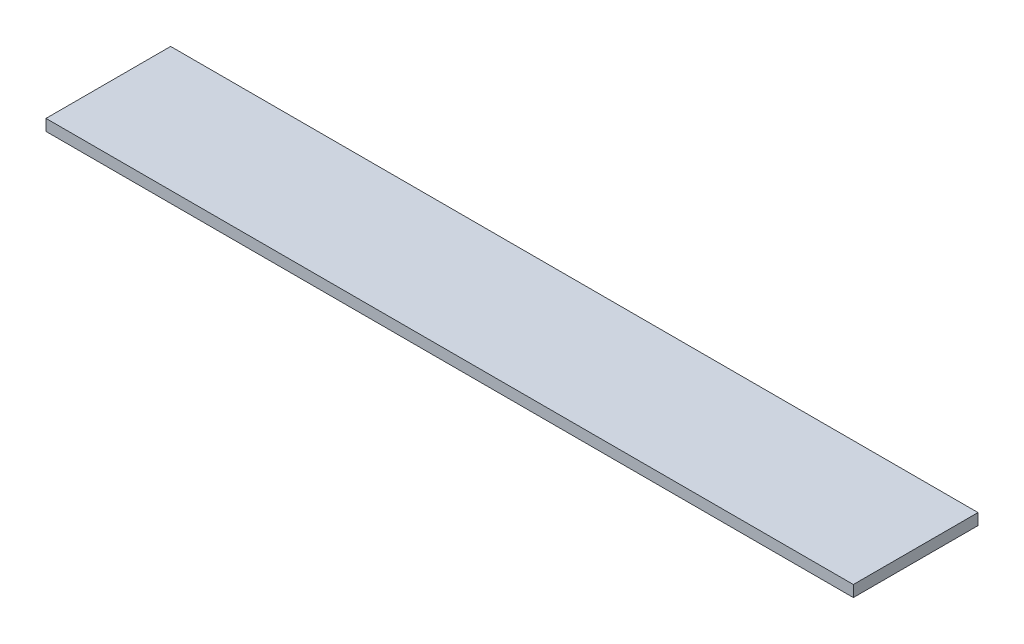
ISO-10303-21;
HEADER;
FILE_DESCRIPTION(('STEP AP214'),'2;1');
FILE_NAME('part.step','',(''),(''),'','','');
FILE_SCHEMA(('AUTOMOTIVE_DESIGN { 1 0 10303 214 1 1 1 1 }'));
ENDSEC;
DATA;
#1=APPLICATION_CONTEXT('core data for automotive mechanical design processes');
#2=APPLICATION_PROTOCOL_DEFINITION('international standard','automotive_design',2000,#1);
#3=PRODUCT_CONTEXT('',#1,'mechanical');
#4=PRODUCT('Part','Part','',(#3));
#5=PRODUCT_RELATED_PRODUCT_CATEGORY('part','',(#4));
#6=PRODUCT_DEFINITION_FORMATION('','',#4);
#7=PRODUCT_DEFINITION_CONTEXT('part definition',#1,'design');
#8=PRODUCT_DEFINITION('design','',#6,#7);
#9=PRODUCT_DEFINITION_SHAPE('','',#8);
#10=(LENGTH_UNIT() NAMED_UNIT(*) SI_UNIT(.MILLI.,.METRE.));
#11=(NAMED_UNIT(*) PLANE_ANGLE_UNIT() SI_UNIT($,.RADIAN.));
#12=(NAMED_UNIT(*) SI_UNIT($,.STERADIAN.) SOLID_ANGLE_UNIT());
#13=UNCERTAINTY_MEASURE_WITH_UNIT(LENGTH_MEASURE(1.E-05),#10,'distance_accuracy_value','');
#14=(GEOMETRIC_REPRESENTATION_CONTEXT(3) GLOBAL_UNCERTAINTY_ASSIGNED_CONTEXT((#13)) GLOBAL_UNIT_ASSIGNED_CONTEXT((#10,
#11,#12)) REPRESENTATION_CONTEXT('',''));
#15=CARTESIAN_POINT('',(0.,0.,0.));
#16=DIRECTION('',(0.,0.,1.));
#17=DIRECTION('',(1.,0.,0.));
#18=AXIS2_PLACEMENT_3D('',#15,#16,#17);
#19=CARTESIAN_POINT('',(-285.000000000039,-4.00000000000027,0.));
#20=DIRECTION('',(-0.999999999999999,0.,0.));
#21=DIRECTION('',(0.,0.,0.999999999999999));
#22=AXIS2_PLACEMENT_3D('',#19,#20,#21);
#23=PLANE('',#22);
#24=DIRECTION('',(0.,0.,0.999999999999999));
#25=VECTOR('',#24,1.);
#26=CARTESIAN_POINT('',(-285.000000000039,-2.91433543964104E-13,0.));
#27=LINE('',#26,#25);
#28=CARTESIAN_POINT('',(-285.000000000039,-2.91433543964104E-13,0.));
#29=VERTEX_POINT('',#28);
#30=CARTESIAN_POINT('',(-285.000000000039,-2.25514051876985E-13,43.9999999999999));
#31=VERTEX_POINT('',#30);
#32=EDGE_CURVE('E98',#29,#31,#27,.T.);
#33=ORIENTED_EDGE('',*,*,#32,.F.);
#34=DIRECTION('',(0.,0.999999999999999,0.));
#35=VECTOR('',#34,1.);
#36=CARTESIAN_POINT('',(-285.000000000039,-4.00000000000027,0.));
#37=LINE('',#36,#35);
#38=CARTESIAN_POINT('',(-285.000000000039,-4.00000000000027,0.));
#39=VERTEX_POINT('',#38);
#40=EDGE_CURVE('E11',#39,#29,#37,.T.);
#41=ORIENTED_EDGE('',*,*,#40,.F.);
#42=DIRECTION('',(0.,0.,0.999999999999999));
#43=VECTOR('',#42,1.);
#44=CARTESIAN_POINT('',(-285.000000000039,-4.00000000000027,0.));
#45=LINE('',#44,#43);
#46=CARTESIAN_POINT('',(-285.000000000039,-4.0000000000002,43.9999999999999));
#47=VERTEX_POINT('',#46);
#48=EDGE_CURVE('E92',#39,#47,#45,.T.);
#49=ORIENTED_EDGE('',*,*,#48,.T.);
#50=DIRECTION('',(0.,0.999999999999999,0.));
#51=VECTOR('',#50,1.);
#52=CARTESIAN_POINT('',(-285.000000000039,-4.0000000000002,43.9999999999999));
#53=LINE('',#52,#51);
#54=EDGE_CURVE('E37',#47,#31,#53,.T.);
#55=ORIENTED_EDGE('',*,*,#54,.T.);
#56=EDGE_LOOP('',(#33,#41,#49,#55));
#57=FACE_BOUND('',#56,.T.);
#58=ADVANCED_FACE('F34',(#57),#23,.T.);
#59=CARTESIAN_POINT('',(-285.000000000039,-4.00000000000027,0.));
#60=DIRECTION('',(0.,0.,-0.999999999999999));
#61=DIRECTION('',(-0.999999999999999,0.,0.));
#62=AXIS2_PLACEMENT_3D('',#59,#60,#61);
#63=PLANE('',#62);
#64=DIRECTION('',(-0.999999999999999,0.,0.));
#65=VECTOR('',#64,1.);
#66=CARTESIAN_POINT('',(-285.000000000039,-2.91433543964104E-13,0.));
#67=LINE('',#66,#65);
#68=CARTESIAN_POINT('',(0.,0.,0.));
#69=VERTEX_POINT('',#68);
#70=EDGE_CURVE('E94',#69,#29,#67,.T.);
#71=ORIENTED_EDGE('',*,*,#70,.F.);
#72=DIRECTION('',(0.,0.999999999999999,0.));
#73=VECTOR('',#72,1.);
#74=CARTESIAN_POINT('',(0.,-4.,0.));
#75=LINE('',#74,#73);
#76=CARTESIAN_POINT('',(0.,-4.,0.));
#77=VERTEX_POINT('',#76);
#78=EDGE_CURVE('E43',#77,#69,#75,.T.);
#79=ORIENTED_EDGE('',*,*,#78,.F.);
#80=DIRECTION('',(-0.999999999999999,0.,0.));
#81=VECTOR('',#80,1.);
#82=CARTESIAN_POINT('',(-285.000000000039,-4.00000000000027,0.));
#83=LINE('',#82,#81);
#84=EDGE_CURVE('E89',#77,#39,#83,.T.);
#85=ORIENTED_EDGE('',*,*,#84,.T.);
#86=ORIENTED_EDGE('',*,*,#40,.T.);
#87=EDGE_LOOP('',(#71,#79,#85,#86));
#88=FACE_BOUND('',#87,.T.);
#89=ADVANCED_FACE('F108',(#88),#63,.T.);
#90=CARTESIAN_POINT('',(0.,-4.,44.));
#91=DIRECTION('',(0.999999999999999,0.,0.));
#92=DIRECTION('',(0.,0.,-0.999999999999999));
#93=AXIS2_PLACEMENT_3D('',#90,#91,#92);
#94=PLANE('',#93);
#95=DIRECTION('',(0.,0.,-0.999999999999999));
#96=VECTOR('',#95,1.);
#97=CARTESIAN_POINT('',(0.,0.,44.));
#98=LINE('',#97,#96);
#99=CARTESIAN_POINT('',(0.,0.,44.));
#100=VERTEX_POINT('',#99);
#101=EDGE_CURVE('E84',#100,#69,#98,.T.);
#102=ORIENTED_EDGE('',*,*,#101,.F.);
#103=DIRECTION('',(0.,0.999999999999999,0.));
#104=VECTOR('',#103,1.);
#105=CARTESIAN_POINT('',(0.,-4.,44.));
#106=LINE('',#105,#104);
#107=CARTESIAN_POINT('',(0.,-4.,44.));
#108=VERTEX_POINT('',#107);
#109=EDGE_CURVE('E79',#108,#100,#106,.T.);
#110=ORIENTED_EDGE('',*,*,#109,.F.);
#111=DIRECTION('',(0.,0.,-0.999999999999999));
#112=VECTOR('',#111,1.);
#113=CARTESIAN_POINT('',(0.,-4.,44.));
#114=LINE('',#113,#112);
#115=EDGE_CURVE('E82',#108,#77,#114,.T.);
#116=ORIENTED_EDGE('',*,*,#115,.T.);
#117=ORIENTED_EDGE('',*,*,#78,.T.);
#118=EDGE_LOOP('',(#102,#110,#116,#117));
#119=FACE_BOUND('',#118,.T.);
#120=ADVANCED_FACE('F81',(#119),#94,.T.);
#121=CARTESIAN_POINT('',(-285.000000000039,-4.0000000000002,43.9999999999999));
#122=DIRECTION('',(0.,0.,0.999999999999999));
#123=DIRECTION('',(0.999999999999999,0.,0.));
#124=AXIS2_PLACEMENT_3D('',#121,#122,#123);
#125=PLANE('',#124);
#126=DIRECTION('',(0.999999999999999,0.,0.));
#127=VECTOR('',#126,1.);
#128=CARTESIAN_POINT('',(-285.000000000039,-2.25514051876985E-13,43.9999999999999));
#129=LINE('',#128,#127);
#130=EDGE_CURVE('E101',#31,#100,#129,.T.);
#131=ORIENTED_EDGE('',*,*,#130,.F.);
#132=ORIENTED_EDGE('',*,*,#54,.F.);
#133=DIRECTION('',(0.999999999999999,0.,0.));
#134=VECTOR('',#133,1.);
#135=CARTESIAN_POINT('',(-285.000000000039,-4.0000000000002,43.9999999999999));
#136=LINE('',#135,#134);
#137=EDGE_CURVE('E88',#47,#108,#136,.T.);
#138=ORIENTED_EDGE('',*,*,#137,.T.);
#139=ORIENTED_EDGE('',*,*,#109,.T.);
#140=EDGE_LOOP('',(#131,#132,#138,#139));
#141=FACE_BOUND('',#140,.T.);
#142=ADVANCED_FACE('F91',(#141),#125,.T.);
#143=CARTESIAN_POINT('',(0.,-4.,0.));
#144=DIRECTION('',(0.,0.999999999999999,0.));
#145=DIRECTION('',(0.,0.,0.999999999999999));
#146=AXIS2_PLACEMENT_3D('',#143,#144,#145);
#147=PLANE('',#146);
#148=ORIENTED_EDGE('',*,*,#48,.F.);
#149=ORIENTED_EDGE('',*,*,#84,.F.);
#150=ORIENTED_EDGE('',*,*,#115,.F.);
#151=ORIENTED_EDGE('',*,*,#137,.F.);
#152=EDGE_LOOP('',(#148,#149,#150,#151));
#153=FACE_BOUND('',#152,.T.);
#154=ADVANCED_FACE('F87',(#153),#147,.F.);
#155=CARTESIAN_POINT('',(0.,0.,0.));
#156=DIRECTION('',(0.,0.999999999999999,0.));
#157=DIRECTION('',(0.,0.,0.999999999999999));
#158=AXIS2_PLACEMENT_3D('',#155,#156,#157);
#159=PLANE('',#158);
#160=ORIENTED_EDGE('',*,*,#32,.T.);
#161=ORIENTED_EDGE('',*,*,#130,.T.);
#162=ORIENTED_EDGE('',*,*,#101,.T.);
#163=ORIENTED_EDGE('',*,*,#70,.T.);
#164=EDGE_LOOP('',(#160,#161,#162,#163));
#165=FACE_BOUND('',#164,.T.);
#166=ADVANCED_FACE('F107',(#165),#159,.T.);
#167=CLOSED_SHELL('',(#58,#89,#120,#142,#154,#166));
#168=MANIFOLD_SOLID_BREP('B2',#167);
#169=ADVANCED_BREP_SHAPE_REPRESENTATION('',(#18,#168),#14);
#170=SHAPE_DEFINITION_REPRESENTATION(#9,#169);
ENDSEC;
END-ISO-10303-21;
